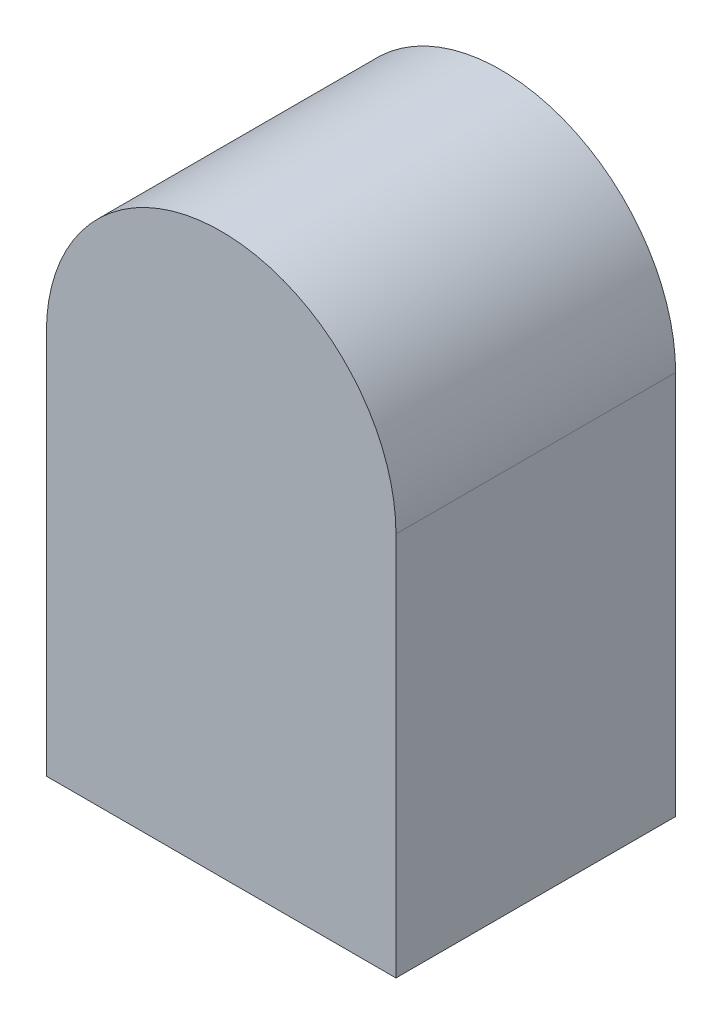
ISO-10303-21;
HEADER;
FILE_DESCRIPTION(('STEP AP214'),'2;1');
FILE_NAME('part.step','',(''),(''),'','','');
FILE_SCHEMA(('AUTOMOTIVE_DESIGN { 1 0 10303 214 1 1 1 1 }'));
ENDSEC;
DATA;
#1=APPLICATION_CONTEXT('core data for automotive mechanical design processes');
#2=APPLICATION_PROTOCOL_DEFINITION('international standard','automotive_design',2000,#1);
#3=PRODUCT_CONTEXT('',#1,'mechanical');
#4=PRODUCT('Part','Part','',(#3));
#5=PRODUCT_RELATED_PRODUCT_CATEGORY('part','',(#4));
#6=PRODUCT_DEFINITION_FORMATION('','',#4);
#7=PRODUCT_DEFINITION_CONTEXT('part definition',#1,'design');
#8=PRODUCT_DEFINITION('design','',#6,#7);
#9=PRODUCT_DEFINITION_SHAPE('','',#8);
#10=(LENGTH_UNIT() NAMED_UNIT(*) SI_UNIT(.MILLI.,.METRE.));
#11=(NAMED_UNIT(*) PLANE_ANGLE_UNIT() SI_UNIT($,.RADIAN.));
#12=(NAMED_UNIT(*) SI_UNIT($,.STERADIAN.) SOLID_ANGLE_UNIT());
#13=UNCERTAINTY_MEASURE_WITH_UNIT(LENGTH_MEASURE(1.E-05),#10,'distance_accuracy_value','');
#14=(GEOMETRIC_REPRESENTATION_CONTEXT(3) GLOBAL_UNCERTAINTY_ASSIGNED_CONTEXT((#13)) GLOBAL_UNIT_ASSIGNED_CONTEXT((#10,
#11,#12)) REPRESENTATION_CONTEXT('',''));
#15=CARTESIAN_POINT('',(0.,0.,0.));
#16=DIRECTION('',(0.,0.,1.));
#17=DIRECTION('',(1.,0.,0.));
#18=AXIS2_PLACEMENT_3D('',#15,#16,#17);
#19=CARTESIAN_POINT('',(-0.499999999999998,-0.725,0.));
#20=DIRECTION('',(0.,0.,1.));
#21=DIRECTION('',(1.,0.,0.));
#22=AXIS2_PLACEMENT_3D('',#19,#20,#21);
#23=CYLINDRICAL_SURFACE('',#22,0.125);
#24=CARTESIAN_POINT('',(-0.499999999999998,-0.725,0.));
#25=DIRECTION('',(0.,0.,1.));
#26=DIRECTION('',(1.,0.,0.));
#27=AXIS2_PLACEMENT_3D('',#24,#25,#26);
#28=CIRCLE('',#27,0.125);
#29=CARTESIAN_POINT('',(-0.374999999999998,-0.724999999999999,0.));
#30=VERTEX_POINT('',#29);
#31=CARTESIAN_POINT('',(-0.624999999999997,-0.725000000000001,0.));
#32=VERTEX_POINT('',#31);
#33=EDGE_CURVE('E11',#30,#32,#28,.T.);
#34=ORIENTED_EDGE('',*,*,#33,.T.);
#35=DIRECTION('',(0.,0.,1.));
#36=VECTOR('',#35,1.);
#37=CARTESIAN_POINT('',(-0.624999999999997,-0.725000000000001,0.));
#38=LINE('',#37,#36);
#39=CARTESIAN_POINT('',(-0.624999999999997,-0.725000000000001,0.2));
#40=VERTEX_POINT('',#39);
#41=EDGE_CURVE('E24',#32,#40,#38,.T.);
#42=ORIENTED_EDGE('',*,*,#41,.T.);
#43=CARTESIAN_POINT('',(-0.499999999999998,-0.725,0.2));
#44=DIRECTION('',(0.,0.,1.));
#45=DIRECTION('',(1.,0.,0.));
#46=AXIS2_PLACEMENT_3D('',#43,#44,#45);
#47=CIRCLE('',#46,0.125);
#48=CARTESIAN_POINT('',(-0.374999999999998,-0.724999999999999,0.2));
#49=VERTEX_POINT('',#48);
#50=EDGE_CURVE('E75',#49,#40,#47,.T.);
#51=ORIENTED_EDGE('',*,*,#50,.F.);
#52=DIRECTION('',(0.,0.,1.));
#53=VECTOR('',#52,1.);
#54=CARTESIAN_POINT('',(-0.374999999999998,-0.724999999999999,0.));
#55=LINE('',#54,#53);
#56=EDGE_CURVE('E86',#30,#49,#55,.T.);
#57=ORIENTED_EDGE('',*,*,#56,.F.);
#58=EDGE_LOOP('',(#34,#42,#51,#57));
#59=FACE_BOUND('',#58,.T.);
#60=ADVANCED_FACE('F17',(#59),#23,.T.);
#61=CARTESIAN_POINT('',(-0.374999999999996,-1.,0.));
#62=DIRECTION('',(1.,0.,0.));
#63=DIRECTION('',(0.,1.,0.));
#64=AXIS2_PLACEMENT_3D('',#61,#62,#63);
#65=PLANE('',#64);
#66=DIRECTION('',(0.,1.,0.));
#67=VECTOR('',#66,1.);
#68=CARTESIAN_POINT('',(-0.374999999999996,-1.,0.));
#69=LINE('',#68,#67);
#70=CARTESIAN_POINT('',(-0.374999999999996,-1.,0.));
#71=VERTEX_POINT('',#70);
#72=EDGE_CURVE('E83',#71,#30,#69,.T.);
#73=ORIENTED_EDGE('',*,*,#72,.T.);
#74=ORIENTED_EDGE('',*,*,#56,.T.);
#75=DIRECTION('',(0.,1.,0.));
#76=VECTOR('',#75,1.);
#77=CARTESIAN_POINT('',(-0.374999999999996,-1.,0.2));
#78=LINE('',#77,#76);
#79=CARTESIAN_POINT('',(-0.374999999999996,-1.,0.2));
#80=VERTEX_POINT('',#79);
#81=EDGE_CURVE('E81',#80,#49,#78,.T.);
#82=ORIENTED_EDGE('',*,*,#81,.F.);
#83=DIRECTION('',(0.,0.,1.));
#84=VECTOR('',#83,1.);
#85=CARTESIAN_POINT('',(-0.374999999999996,-1.,0.));
#86=LINE('',#85,#84);
#87=EDGE_CURVE('E61',#71,#80,#86,.T.);
#88=ORIENTED_EDGE('',*,*,#87,.F.);
#89=EDGE_LOOP('',(#73,#74,#82,#88));
#90=FACE_BOUND('',#89,.T.);
#91=ADVANCED_FACE('F91',(#90),#65,.T.);
#92=CARTESIAN_POINT('',(-0.624999999999996,-1.,0.));
#93=DIRECTION('',(0.,-1.,0.));
#94=DIRECTION('',(1.,0.,0.));
#95=AXIS2_PLACEMENT_3D('',#92,#93,#94);
#96=PLANE('',#95);
#97=DIRECTION('',(1.,0.,0.));
#98=VECTOR('',#97,1.);
#99=CARTESIAN_POINT('',(-0.624999999999996,-1.,0.));
#100=LINE('',#99,#98);
#101=CARTESIAN_POINT('',(-0.624999999999996,-1.,0.));
#102=VERTEX_POINT('',#101);
#103=EDGE_CURVE('E65',#102,#71,#100,.T.);
#104=ORIENTED_EDGE('',*,*,#103,.T.);
#105=ORIENTED_EDGE('',*,*,#87,.T.);
#106=DIRECTION('',(1.,0.,0.));
#107=VECTOR('',#106,1.);
#108=CARTESIAN_POINT('',(-0.624999999999996,-1.,0.2));
#109=LINE('',#108,#107);
#110=CARTESIAN_POINT('',(-0.624999999999996,-1.,0.2));
#111=VERTEX_POINT('',#110);
#112=EDGE_CURVE('E54',#111,#80,#109,.T.);
#113=ORIENTED_EDGE('',*,*,#112,.F.);
#114=DIRECTION('',(0.,0.,1.));
#115=VECTOR('',#114,1.);
#116=CARTESIAN_POINT('',(-0.624999999999996,-1.,0.));
#117=LINE('',#116,#115);
#118=EDGE_CURVE('E58',#102,#111,#117,.T.);
#119=ORIENTED_EDGE('',*,*,#118,.F.);
#120=EDGE_LOOP('',(#104,#105,#113,#119));
#121=FACE_BOUND('',#120,.T.);
#122=ADVANCED_FACE('F57',(#121),#96,.T.);
#123=CARTESIAN_POINT('',(-0.624999999999997,-0.725000000000001,0.));
#124=DIRECTION('',(-1.,0.,0.));
#125=DIRECTION('',(0.,-1.,0.));
#126=AXIS2_PLACEMENT_3D('',#123,#124,#125);
#127=PLANE('',#126);
#128=DIRECTION('',(0.,-1.,0.));
#129=VECTOR('',#128,1.);
#130=CARTESIAN_POINT('',(-0.624999999999997,-0.725000000000001,0.));
#131=LINE('',#130,#129);
#132=EDGE_CURVE('E71',#32,#102,#131,.T.);
#133=ORIENTED_EDGE('',*,*,#132,.T.);
#134=ORIENTED_EDGE('',*,*,#118,.T.);
#135=DIRECTION('',(0.,-1.,0.));
#136=VECTOR('',#135,1.);
#137=CARTESIAN_POINT('',(-0.624999999999997,-0.725000000000001,0.2));
#138=LINE('',#137,#136);
#139=EDGE_CURVE('E70',#40,#111,#138,.T.);
#140=ORIENTED_EDGE('',*,*,#139,.F.);
#141=ORIENTED_EDGE('',*,*,#41,.F.);
#142=EDGE_LOOP('',(#133,#134,#140,#141));
#143=FACE_BOUND('',#142,.T.);
#144=ADVANCED_FACE('F69',(#143),#127,.T.);
#145=CARTESIAN_POINT('',(-0.499999999999997,-0.8,0.2));
#146=DIRECTION('',(0.,0.,1.));
#147=DIRECTION('',(1.,0.,0.));
#148=AXIS2_PLACEMENT_3D('',#145,#146,#147);
#149=PLANE('',#148);
#150=ORIENTED_EDGE('',*,*,#139,.T.);
#151=ORIENTED_EDGE('',*,*,#112,.T.);
#152=ORIENTED_EDGE('',*,*,#81,.T.);
#153=ORIENTED_EDGE('',*,*,#50,.T.);
#154=EDGE_LOOP('',(#150,#151,#152,#153));
#155=FACE_BOUND('',#154,.T.);
#156=ADVANCED_FACE('F74',(#155),#149,.T.);
#157=CARTESIAN_POINT('',(-0.499999999999997,-0.8,0.));
#158=DIRECTION('',(0.,0.,1.));
#159=DIRECTION('',(1.,0.,0.));
#160=AXIS2_PLACEMENT_3D('',#157,#158,#159);
#161=PLANE('',#160);
#162=ORIENTED_EDGE('',*,*,#132,.F.);
#163=ORIENTED_EDGE('',*,*,#33,.F.);
#164=ORIENTED_EDGE('',*,*,#72,.F.);
#165=ORIENTED_EDGE('',*,*,#103,.F.);
#166=EDGE_LOOP('',(#162,#163,#164,#165));
#167=FACE_BOUND('',#166,.T.);
#168=ADVANCED_FACE('F89',(#167),#161,.F.);
#169=CLOSED_SHELL('',(#60,#91,#122,#144,#156,#168));
#170=MANIFOLD_SOLID_BREP('B1',#169);
#171=ADVANCED_BREP_SHAPE_REPRESENTATION('',(#18,#170),#14);
#172=SHAPE_DEFINITION_REPRESENTATION(#9,#171);
ENDSEC;
END-ISO-10303-21;
